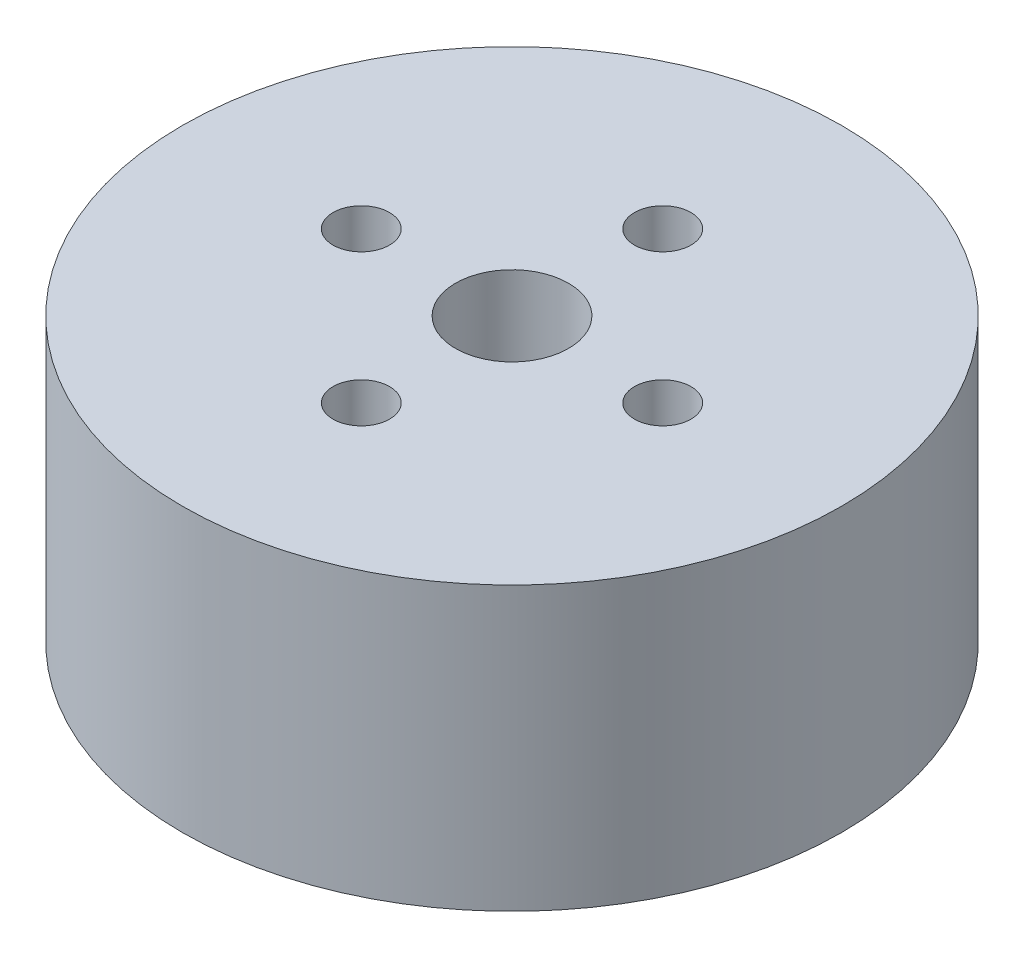
ISO-10303-21;
HEADER;
FILE_DESCRIPTION(('STEP AP214'),'2;1');
FILE_NAME('part.step','',(''),(''),'','','');
FILE_SCHEMA(('AUTOMOTIVE_DESIGN { 1 0 10303 214 1 1 1 1 }'));
ENDSEC;
DATA;
#1=APPLICATION_CONTEXT('core data for automotive mechanical design processes');
#2=APPLICATION_PROTOCOL_DEFINITION('international standard','automotive_design',2000,#1);
#3=PRODUCT_CONTEXT('',#1,'mechanical');
#4=PRODUCT('Part','Part','',(#3));
#5=PRODUCT_RELATED_PRODUCT_CATEGORY('part','',(#4));
#6=PRODUCT_DEFINITION_FORMATION('','',#4);
#7=PRODUCT_DEFINITION_CONTEXT('part definition',#1,'design');
#8=PRODUCT_DEFINITION('design','',#6,#7);
#9=PRODUCT_DEFINITION_SHAPE('','',#8);
#10=(LENGTH_UNIT() NAMED_UNIT(*) SI_UNIT(.MILLI.,.METRE.));
#11=(NAMED_UNIT(*) PLANE_ANGLE_UNIT() SI_UNIT($,.RADIAN.));
#12=(NAMED_UNIT(*) SI_UNIT($,.STERADIAN.) SOLID_ANGLE_UNIT());
#13=UNCERTAINTY_MEASURE_WITH_UNIT(LENGTH_MEASURE(1.E-05),#10,'distance_accuracy_value','');
#14=(GEOMETRIC_REPRESENTATION_CONTEXT(3) GLOBAL_UNCERTAINTY_ASSIGNED_CONTEXT((#13)) GLOBAL_UNIT_ASSIGNED_CONTEXT((#10,
#11,#12)) REPRESENTATION_CONTEXT('',''));
#15=CARTESIAN_POINT('',(0.,0.,0.));
#16=DIRECTION('',(0.,0.,1.));
#17=DIRECTION('',(1.,0.,0.));
#18=AXIS2_PLACEMENT_3D('',#15,#16,#17);
#19=CARTESIAN_POINT('',(0.,15.,0.));
#20=DIRECTION('',(0.,-1.,0.));
#21=DIRECTION('',(0.,0.,-1.));
#22=AXIS2_PLACEMENT_3D('',#19,#20,#21);
#23=CYLINDRICAL_SURFACE('',#22,17.5);
#24=CARTESIAN_POINT('',(0.,15.,0.));
#25=DIRECTION('',(0.,1.,0.));
#26=DIRECTION('',(0.,0.,1.));
#27=AXIS2_PLACEMENT_3D('',#24,#25,#26);
#28=CIRCLE('',#27,17.5);
#29=CARTESIAN_POINT('',(0.,15.,17.5));
#30=VERTEX_POINT('',#29);
#31=EDGE_CURVE('E10',#30,#30,#28,.T.);
#32=ORIENTED_EDGE('',*,*,#31,.F.);
#33=EDGE_LOOP('',(#32));
#34=FACE_BOUND('',#33,.T.);
#35=CARTESIAN_POINT('',(0.,0.,0.));
#36=DIRECTION('',(0.,1.,0.));
#37=DIRECTION('',(0.,0.,1.));
#38=AXIS2_PLACEMENT_3D('',#35,#36,#37);
#39=CIRCLE('',#38,17.5);
#40=CARTESIAN_POINT('',(0.,0.,17.5));
#41=VERTEX_POINT('',#40);
#42=EDGE_CURVE('E39',#41,#41,#39,.T.);
#43=ORIENTED_EDGE('',*,*,#42,.T.);
#44=EDGE_LOOP('',(#43));
#45=FACE_BOUND('',#44,.T.);
#46=ADVANCED_FACE('F36',(#34,#45),#23,.T.);
#47=CARTESIAN_POINT('',(0.,15.,0.));
#48=DIRECTION('',(0.,1.,0.));
#49=DIRECTION('',(0.,0.,1.));
#50=AXIS2_PLACEMENT_3D('',#47,#48,#49);
#51=PLANE('',#50);
#52=CARTESIAN_POINT('',(0.,15.,-8.));
#53=DIRECTION('',(0.,1.,0.));
#54=DIRECTION('',(0.,0.,1.));
#55=AXIS2_PLACEMENT_3D('',#52,#53,#54);
#56=CIRCLE('',#55,1.5);
#57=CARTESIAN_POINT('',(0.,15.,-6.5));
#58=VERTEX_POINT('',#57);
#59=EDGE_CURVE('E73',#58,#58,#56,.T.);
#60=ORIENTED_EDGE('',*,*,#59,.F.);
#61=EDGE_LOOP('',(#60));
#62=FACE_BOUND('',#61,.T.);
#63=CARTESIAN_POINT('',(8.,15.,0.));
#64=DIRECTION('',(0.,1.,0.));
#65=DIRECTION('',(0.,0.,1.));
#66=AXIS2_PLACEMENT_3D('',#63,#64,#65);
#67=CIRCLE('',#66,1.5);
#68=CARTESIAN_POINT('',(8.,15.,1.5));
#69=VERTEX_POINT('',#68);
#70=EDGE_CURVE('E67',#69,#69,#67,.T.);
#71=ORIENTED_EDGE('',*,*,#70,.F.);
#72=EDGE_LOOP('',(#71));
#73=FACE_BOUND('',#72,.T.);
#74=CARTESIAN_POINT('',(0.,15.,8.));
#75=DIRECTION('',(0.,1.,0.));
#76=DIRECTION('',(0.,0.,1.));
#77=AXIS2_PLACEMENT_3D('',#74,#75,#76);
#78=CIRCLE('',#77,1.5);
#79=CARTESIAN_POINT('',(0.,15.,9.5));
#80=VERTEX_POINT('',#79);
#81=EDGE_CURVE('E61',#80,#80,#78,.T.);
#82=ORIENTED_EDGE('',*,*,#81,.F.);
#83=EDGE_LOOP('',(#82));
#84=FACE_BOUND('',#83,.T.);
#85=CARTESIAN_POINT('',(-8.,15.,0.));
#86=DIRECTION('',(0.,1.,0.));
#87=DIRECTION('',(0.,0.,1.));
#88=AXIS2_PLACEMENT_3D('',#85,#86,#87);
#89=CIRCLE('',#88,1.5);
#90=CARTESIAN_POINT('',(-8.,15.,1.5));
#91=VERTEX_POINT('',#90);
#92=EDGE_CURVE('E54',#91,#91,#89,.T.);
#93=ORIENTED_EDGE('',*,*,#92,.F.);
#94=EDGE_LOOP('',(#93));
#95=FACE_BOUND('',#94,.T.);
#96=CARTESIAN_POINT('',(0.,15.,0.));
#97=DIRECTION('',(0.,-1.,0.));
#98=DIRECTION('',(0.,0.,-1.));
#99=AXIS2_PLACEMENT_3D('',#96,#97,#98);
#100=CIRCLE('',#99,3.);
#101=CARTESIAN_POINT('',(0.,15.,-3.));
#102=VERTEX_POINT('',#101);
#103=EDGE_CURVE('E46',#102,#102,#100,.T.);
#104=ORIENTED_EDGE('',*,*,#103,.T.);
#105=EDGE_LOOP('',(#104));
#106=FACE_BOUND('',#105,.T.);
#107=ORIENTED_EDGE('',*,*,#31,.T.);
#108=EDGE_LOOP('',(#107));
#109=FACE_BOUND('',#108,.T.);
#110=ADVANCED_FACE('F115',(#62,#73,#84,#95,#106,#109),#51,.T.);
#111=CARTESIAN_POINT('',(0.,0.,0.));
#112=DIRECTION('',(0.,1.,0.));
#113=DIRECTION('',(0.,0.,1.));
#114=AXIS2_PLACEMENT_3D('',#111,#112,#113);
#115=PLANE('',#114);
#116=CARTESIAN_POINT('',(0.,0.,9.5));
#117=DIRECTION('',(0.,-1.,0.));
#118=DIRECTION('',(0.,0.,-1.));
#119=AXIS2_PLACEMENT_3D('',#116,#117,#118);
#120=CIRCLE('',#119,1.5);
#121=CARTESIAN_POINT('',(0.,0.,8.));
#122=VERTEX_POINT('',#121);
#123=EDGE_CURVE('E96',#122,#122,#120,.T.);
#124=ORIENTED_EDGE('',*,*,#123,.F.);
#125=EDGE_LOOP('',(#124));
#126=FACE_BOUND('',#125,.T.);
#127=CARTESIAN_POINT('',(9.5,0.,0.));
#128=DIRECTION('',(0.,-1.,0.));
#129=DIRECTION('',(0.,0.,-1.));
#130=AXIS2_PLACEMENT_3D('',#127,#128,#129);
#131=CIRCLE('',#130,1.5);
#132=CARTESIAN_POINT('',(9.5,0.,-1.5));
#133=VERTEX_POINT('',#132);
#134=EDGE_CURVE('E90',#133,#133,#131,.T.);
#135=ORIENTED_EDGE('',*,*,#134,.F.);
#136=EDGE_LOOP('',(#135));
#137=FACE_BOUND('',#136,.T.);
#138=CARTESIAN_POINT('',(0.,0.,-9.5));
#139=DIRECTION('',(0.,-1.,0.));
#140=DIRECTION('',(0.,0.,-1.));
#141=AXIS2_PLACEMENT_3D('',#138,#139,#140);
#142=CIRCLE('',#141,1.5);
#143=CARTESIAN_POINT('',(0.,0.,-11.));
#144=VERTEX_POINT('',#143);
#145=EDGE_CURVE('E84',#144,#144,#142,.T.);
#146=ORIENTED_EDGE('',*,*,#145,.F.);
#147=EDGE_LOOP('',(#146));
#148=FACE_BOUND('',#147,.T.);
#149=CARTESIAN_POINT('',(-9.5,0.,0.));
#150=DIRECTION('',(0.,-1.,0.));
#151=DIRECTION('',(0.,0.,-1.));
#152=AXIS2_PLACEMENT_3D('',#149,#150,#151);
#153=CIRCLE('',#152,1.5);
#154=CARTESIAN_POINT('',(-9.5,0.,-1.5));
#155=VERTEX_POINT('',#154);
#156=EDGE_CURVE('E78',#155,#155,#153,.T.);
#157=ORIENTED_EDGE('',*,*,#156,.F.);
#158=EDGE_LOOP('',(#157));
#159=FACE_BOUND('',#158,.T.);
#160=CARTESIAN_POINT('',(0.,0.,0.));
#161=DIRECTION('',(0.,-1.,0.));
#162=DIRECTION('',(0.,0.,-1.));
#163=AXIS2_PLACEMENT_3D('',#160,#161,#162);
#164=CIRCLE('',#163,3.);
#165=CARTESIAN_POINT('',(0.,0.,-3.));
#166=VERTEX_POINT('',#165);
#167=EDGE_CURVE('E48',#166,#166,#164,.T.);
#168=ORIENTED_EDGE('',*,*,#167,.F.);
#169=EDGE_LOOP('',(#168));
#170=FACE_BOUND('',#169,.T.);
#171=ORIENTED_EDGE('',*,*,#42,.F.);
#172=EDGE_LOOP('',(#171));
#173=FACE_BOUND('',#172,.T.);
#174=ADVANCED_FACE('F111',(#126,#137,#148,#159,#170,#173),#115,.F.);
#175=CARTESIAN_POINT('',(0.,15.,0.));
#176=DIRECTION('',(0.,-1.,0.));
#177=DIRECTION('',(0.,0.,-1.));
#178=AXIS2_PLACEMENT_3D('',#175,#176,#177);
#179=CYLINDRICAL_SURFACE('',#178,3.);
#180=ORIENTED_EDGE('',*,*,#103,.F.);
#181=EDGE_LOOP('',(#180));
#182=FACE_BOUND('',#181,.T.);
#183=ORIENTED_EDGE('',*,*,#167,.T.);
#184=EDGE_LOOP('',(#183));
#185=FACE_BOUND('',#184,.T.);
#186=ADVANCED_FACE('F114',(#182,#185),#179,.F.);
#187=CARTESIAN_POINT('',(-8.,10.,0.));
#188=DIRECTION('',(0.,1.,0.));
#189=DIRECTION('',(0.,0.,1.));
#190=AXIS2_PLACEMENT_3D('',#187,#188,#189);
#191=CYLINDRICAL_SURFACE('',#190,1.5);
#192=CARTESIAN_POINT('',(-8.,10.,0.));
#193=DIRECTION('',(0.,1.,0.));
#194=DIRECTION('',(0.,0.,1.));
#195=AXIS2_PLACEMENT_3D('',#192,#193,#194);
#196=CIRCLE('',#195,1.5);
#197=CARTESIAN_POINT('',(-8.,10.,1.5));
#198=VERTEX_POINT('',#197);
#199=EDGE_CURVE('E57',#198,#198,#196,.T.);
#200=ORIENTED_EDGE('',*,*,#199,.F.);
#201=EDGE_LOOP('',(#200));
#202=FACE_BOUND('',#201,.T.);
#203=ORIENTED_EDGE('',*,*,#92,.T.);
#204=EDGE_LOOP('',(#203));
#205=FACE_BOUND('',#204,.T.);
#206=ADVANCED_FACE('F140',(#202,#205),#191,.F.);
#207=CARTESIAN_POINT('',(-8.,10.,0.));
#208=DIRECTION('',(0.,1.,0.));
#209=DIRECTION('',(0.,0.,1.));
#210=AXIS2_PLACEMENT_3D('',#207,#208,#209);
#211=PLANE('',#210);
#212=ORIENTED_EDGE('',*,*,#199,.T.);
#213=EDGE_LOOP('',(#212));
#214=FACE_BOUND('',#213,.T.);
#215=ADVANCED_FACE('F144',(#214),#211,.T.);
#216=CARTESIAN_POINT('',(0.,10.,8.));
#217=DIRECTION('',(0.,1.,0.));
#218=DIRECTION('',(0.,0.,1.));
#219=AXIS2_PLACEMENT_3D('',#216,#217,#218);
#220=CYLINDRICAL_SURFACE('',#219,1.5);
#221=CARTESIAN_POINT('',(0.,10.,8.));
#222=DIRECTION('',(0.,1.,0.));
#223=DIRECTION('',(0.,0.,1.));
#224=AXIS2_PLACEMENT_3D('',#221,#222,#223);
#225=CIRCLE('',#224,1.5);
#226=CARTESIAN_POINT('',(0.,10.,9.5));
#227=VERTEX_POINT('',#226);
#228=EDGE_CURVE('E64',#227,#227,#225,.T.);
#229=ORIENTED_EDGE('',*,*,#228,.F.);
#230=EDGE_LOOP('',(#229));
#231=FACE_BOUND('',#230,.T.);
#232=ORIENTED_EDGE('',*,*,#81,.T.);
#233=EDGE_LOOP('',(#232));
#234=FACE_BOUND('',#233,.T.);
#235=ADVANCED_FACE('F148',(#231,#234),#220,.F.);
#236=CARTESIAN_POINT('',(0.,10.,8.));
#237=DIRECTION('',(0.,1.,0.));
#238=DIRECTION('',(0.,0.,1.));
#239=AXIS2_PLACEMENT_3D('',#236,#237,#238);
#240=PLANE('',#239);
#241=ORIENTED_EDGE('',*,*,#228,.T.);
#242=EDGE_LOOP('',(#241));
#243=FACE_BOUND('',#242,.T.);
#244=ADVANCED_FACE('F152',(#243),#240,.T.);
#245=CARTESIAN_POINT('',(8.,10.,0.));
#246=DIRECTION('',(0.,1.,0.));
#247=DIRECTION('',(0.,0.,1.));
#248=AXIS2_PLACEMENT_3D('',#245,#246,#247);
#249=CYLINDRICAL_SURFACE('',#248,1.5);
#250=CARTESIAN_POINT('',(8.,10.,0.));
#251=DIRECTION('',(0.,1.,0.));
#252=DIRECTION('',(0.,0.,1.));
#253=AXIS2_PLACEMENT_3D('',#250,#251,#252);
#254=CIRCLE('',#253,1.5);
#255=CARTESIAN_POINT('',(8.,10.,1.5));
#256=VERTEX_POINT('',#255);
#257=EDGE_CURVE('E70',#256,#256,#254,.T.);
#258=ORIENTED_EDGE('',*,*,#257,.F.);
#259=EDGE_LOOP('',(#258));
#260=FACE_BOUND('',#259,.T.);
#261=ORIENTED_EDGE('',*,*,#70,.T.);
#262=EDGE_LOOP('',(#261));
#263=FACE_BOUND('',#262,.T.);
#264=ADVANCED_FACE('F156',(#260,#263),#249,.F.);
#265=CARTESIAN_POINT('',(8.,10.,0.));
#266=DIRECTION('',(0.,1.,0.));
#267=DIRECTION('',(0.,0.,1.));
#268=AXIS2_PLACEMENT_3D('',#265,#266,#267);
#269=PLANE('',#268);
#270=ORIENTED_EDGE('',*,*,#257,.T.);
#271=EDGE_LOOP('',(#270));
#272=FACE_BOUND('',#271,.T.);
#273=ADVANCED_FACE('F160',(#272),#269,.T.);
#274=CARTESIAN_POINT('',(0.,10.,-8.));
#275=DIRECTION('',(0.,1.,0.));
#276=DIRECTION('',(0.,0.,1.));
#277=AXIS2_PLACEMENT_3D('',#274,#275,#276);
#278=CYLINDRICAL_SURFACE('',#277,1.5);
#279=CARTESIAN_POINT('',(0.,10.,-8.));
#280=DIRECTION('',(0.,1.,0.));
#281=DIRECTION('',(0.,0.,1.));
#282=AXIS2_PLACEMENT_3D('',#279,#280,#281);
#283=CIRCLE('',#282,1.5);
#284=CARTESIAN_POINT('',(0.,10.,-6.5));
#285=VERTEX_POINT('',#284);
#286=EDGE_CURVE('E51',#285,#285,#283,.T.);
#287=ORIENTED_EDGE('',*,*,#286,.F.);
#288=EDGE_LOOP('',(#287));
#289=FACE_BOUND('',#288,.T.);
#290=ORIENTED_EDGE('',*,*,#59,.T.);
#291=EDGE_LOOP('',(#290));
#292=FACE_BOUND('',#291,.T.);
#293=ADVANCED_FACE('F164',(#289,#292),#278,.F.);
#294=CARTESIAN_POINT('',(0.,10.,-8.));
#295=DIRECTION('',(0.,1.,0.));
#296=DIRECTION('',(0.,0.,1.));
#297=AXIS2_PLACEMENT_3D('',#294,#295,#296);
#298=PLANE('',#297);
#299=ORIENTED_EDGE('',*,*,#286,.T.);
#300=EDGE_LOOP('',(#299));
#301=FACE_BOUND('',#300,.T.);
#302=ADVANCED_FACE('F168',(#301),#298,.T.);
#303=CARTESIAN_POINT('',(-9.5,5.,0.));
#304=DIRECTION('',(0.,-1.,0.));
#305=DIRECTION('',(0.,0.,-1.));
#306=AXIS2_PLACEMENT_3D('',#303,#304,#305);
#307=CYLINDRICAL_SURFACE('',#306,1.5);
#308=CARTESIAN_POINT('',(-9.5,5.,0.));
#309=DIRECTION('',(0.,-1.,0.));
#310=DIRECTION('',(0.,0.,-1.));
#311=AXIS2_PLACEMENT_3D('',#308,#309,#310);
#312=CIRCLE('',#311,1.5);
#313=CARTESIAN_POINT('',(-9.5,5.,-1.5));
#314=VERTEX_POINT('',#313);
#315=EDGE_CURVE('E81',#314,#314,#312,.T.);
#316=ORIENTED_EDGE('',*,*,#315,.F.);
#317=EDGE_LOOP('',(#316));
#318=FACE_BOUND('',#317,.T.);
#319=ORIENTED_EDGE('',*,*,#156,.T.);
#320=EDGE_LOOP('',(#319));
#321=FACE_BOUND('',#320,.T.);
#322=ADVANCED_FACE('F172',(#318,#321),#307,.F.);
#323=CARTESIAN_POINT('',(-9.5,5.,0.));
#324=DIRECTION('',(0.,-1.,0.));
#325=DIRECTION('',(0.,0.,-1.));
#326=AXIS2_PLACEMENT_3D('',#323,#324,#325);
#327=PLANE('',#326);
#328=ORIENTED_EDGE('',*,*,#315,.T.);
#329=EDGE_LOOP('',(#328));
#330=FACE_BOUND('',#329,.T.);
#331=ADVANCED_FACE('F176',(#330),#327,.T.);
#332=CARTESIAN_POINT('',(0.,5.,-9.5));
#333=DIRECTION('',(0.,-1.,0.));
#334=DIRECTION('',(0.,0.,-1.));
#335=AXIS2_PLACEMENT_3D('',#332,#333,#334);
#336=CYLINDRICAL_SURFACE('',#335,1.5);
#337=CARTESIAN_POINT('',(0.,5.,-9.5));
#338=DIRECTION('',(0.,-1.,0.));
#339=DIRECTION('',(0.,0.,-1.));
#340=AXIS2_PLACEMENT_3D('',#337,#338,#339);
#341=CIRCLE('',#340,1.5);
#342=CARTESIAN_POINT('',(0.,5.,-11.));
#343=VERTEX_POINT('',#342);
#344=EDGE_CURVE('E87',#343,#343,#341,.T.);
#345=ORIENTED_EDGE('',*,*,#344,.F.);
#346=EDGE_LOOP('',(#345));
#347=FACE_BOUND('',#346,.T.);
#348=ORIENTED_EDGE('',*,*,#145,.T.);
#349=EDGE_LOOP('',(#348));
#350=FACE_BOUND('',#349,.T.);
#351=ADVANCED_FACE('F180',(#347,#350),#336,.F.);
#352=CARTESIAN_POINT('',(0.,5.,-9.5));
#353=DIRECTION('',(0.,-1.,0.));
#354=DIRECTION('',(0.,0.,-1.));
#355=AXIS2_PLACEMENT_3D('',#352,#353,#354);
#356=PLANE('',#355);
#357=ORIENTED_EDGE('',*,*,#344,.T.);
#358=EDGE_LOOP('',(#357));
#359=FACE_BOUND('',#358,.T.);
#360=ADVANCED_FACE('F184',(#359),#356,.T.);
#361=CARTESIAN_POINT('',(9.5,5.,0.));
#362=DIRECTION('',(0.,-1.,0.));
#363=DIRECTION('',(0.,0.,-1.));
#364=AXIS2_PLACEMENT_3D('',#361,#362,#363);
#365=CYLINDRICAL_SURFACE('',#364,1.5);
#366=CARTESIAN_POINT('',(9.5,5.,0.));
#367=DIRECTION('',(0.,-1.,0.));
#368=DIRECTION('',(0.,0.,-1.));
#369=AXIS2_PLACEMENT_3D('',#366,#367,#368);
#370=CIRCLE('',#369,1.5);
#371=CARTESIAN_POINT('',(9.5,5.,-1.5));
#372=VERTEX_POINT('',#371);
#373=EDGE_CURVE('E93',#372,#372,#370,.T.);
#374=ORIENTED_EDGE('',*,*,#373,.F.);
#375=EDGE_LOOP('',(#374));
#376=FACE_BOUND('',#375,.T.);
#377=ORIENTED_EDGE('',*,*,#134,.T.);
#378=EDGE_LOOP('',(#377));
#379=FACE_BOUND('',#378,.T.);
#380=ADVANCED_FACE('F188',(#376,#379),#365,.F.);
#381=CARTESIAN_POINT('',(9.5,5.,0.));
#382=DIRECTION('',(0.,-1.,0.));
#383=DIRECTION('',(0.,0.,-1.));
#384=AXIS2_PLACEMENT_3D('',#381,#382,#383);
#385=PLANE('',#384);
#386=ORIENTED_EDGE('',*,*,#373,.T.);
#387=EDGE_LOOP('',(#386));
#388=FACE_BOUND('',#387,.T.);
#389=ADVANCED_FACE('F107',(#388),#385,.T.);
#390=CARTESIAN_POINT('',(0.,5.,9.5));
#391=DIRECTION('',(0.,-1.,0.));
#392=DIRECTION('',(0.,0.,-1.));
#393=AXIS2_PLACEMENT_3D('',#390,#391,#392);
#394=CYLINDRICAL_SURFACE('',#393,1.5);
#395=CARTESIAN_POINT('',(0.,5.,9.5));
#396=DIRECTION('',(0.,-1.,0.));
#397=DIRECTION('',(0.,0.,-1.));
#398=AXIS2_PLACEMENT_3D('',#395,#396,#397);
#399=CIRCLE('',#398,1.5);
#400=CARTESIAN_POINT('',(0.,5.,8.));
#401=VERTEX_POINT('',#400);
#402=EDGE_CURVE('E58',#401,#401,#399,.T.);
#403=ORIENTED_EDGE('',*,*,#402,.F.);
#404=EDGE_LOOP('',(#403));
#405=FACE_BOUND('',#404,.T.);
#406=ORIENTED_EDGE('',*,*,#123,.T.);
#407=EDGE_LOOP('',(#406));
#408=FACE_BOUND('',#407,.T.);
#409=ADVANCED_FACE('F104',(#405,#408),#394,.F.);
#410=CARTESIAN_POINT('',(0.,5.,9.5));
#411=DIRECTION('',(0.,-1.,0.));
#412=DIRECTION('',(0.,0.,-1.));
#413=AXIS2_PLACEMENT_3D('',#410,#411,#412);
#414=PLANE('',#413);
#415=ORIENTED_EDGE('',*,*,#402,.T.);
#416=EDGE_LOOP('',(#415));
#417=FACE_BOUND('',#416,.T.);
#418=ADVANCED_FACE('F102',(#417),#414,.T.);
#419=CLOSED_SHELL('',(#46,#110,#174,#186,#206,#215,#235,#244,#264,#273,#293,#302,#322,#331,#351,
#360,#380,#389,#409,#418));
#420=MANIFOLD_SOLID_BREP('B2',#419);
#421=ADVANCED_BREP_SHAPE_REPRESENTATION('',(#18,#420),#14);
#422=SHAPE_DEFINITION_REPRESENTATION(#9,#421);
ENDSEC;
END-ISO-10303-21;
